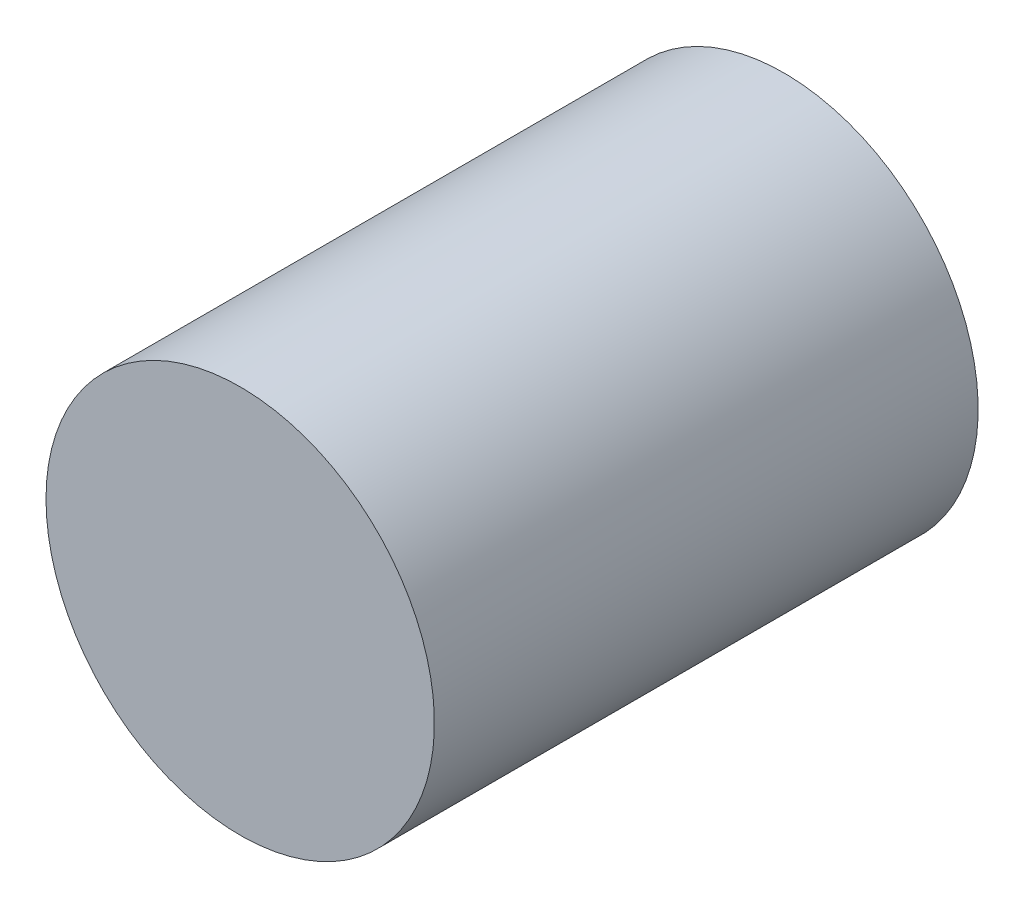
ISO-10303-21;
HEADER;
FILE_DESCRIPTION(('STEP AP214'),'2;1');
FILE_NAME('part.step','',(''),(''),'','','');
FILE_SCHEMA(('AUTOMOTIVE_DESIGN { 1 0 10303 214 1 1 1 1 }'));
ENDSEC;
DATA;
#1=APPLICATION_CONTEXT('core data for automotive mechanical design processes');
#2=APPLICATION_PROTOCOL_DEFINITION('international standard','automotive_design',2000,#1);
#3=PRODUCT_CONTEXT('',#1,'mechanical');
#4=PRODUCT('Part','Part','',(#3));
#5=PRODUCT_RELATED_PRODUCT_CATEGORY('part','',(#4));
#6=PRODUCT_DEFINITION_FORMATION('','',#4);
#7=PRODUCT_DEFINITION_CONTEXT('part definition',#1,'design');
#8=PRODUCT_DEFINITION('design','',#6,#7);
#9=PRODUCT_DEFINITION_SHAPE('','',#8);
#10=(LENGTH_UNIT() NAMED_UNIT(*) SI_UNIT(.MILLI.,.METRE.));
#11=(NAMED_UNIT(*) PLANE_ANGLE_UNIT() SI_UNIT($,.RADIAN.));
#12=(NAMED_UNIT(*) SI_UNIT($,.STERADIAN.) SOLID_ANGLE_UNIT());
#13=UNCERTAINTY_MEASURE_WITH_UNIT(LENGTH_MEASURE(1.E-05),#10,'distance_accuracy_value','');
#14=(GEOMETRIC_REPRESENTATION_CONTEXT(3) GLOBAL_UNCERTAINTY_ASSIGNED_CONTEXT((#13)) GLOBAL_UNIT_ASSIGNED_CONTEXT((#10,
#11,#12)) REPRESENTATION_CONTEXT('',''));
#15=CARTESIAN_POINT('',(0.,0.,0.));
#16=DIRECTION('',(0.,0.,1.));
#17=DIRECTION('',(1.,0.,0.));
#18=AXIS2_PLACEMENT_3D('',#15,#16,#17);
#19=CARTESIAN_POINT('',(0.,92.5,9.5));
#20=DIRECTION('',(0.,0.,-1.));
#21=DIRECTION('',(-1.,0.,0.));
#22=AXIS2_PLACEMENT_3D('',#19,#20,#21);
#23=CYLINDRICAL_SURFACE('',#22,5.);
#24=CARTESIAN_POINT('',(0.,92.5,9.5));
#25=DIRECTION('',(0.,0.,-1.));
#26=DIRECTION('',(-1.,0.,0.));
#27=AXIS2_PLACEMENT_3D('',#24,#25,#26);
#28=CIRCLE('',#27,5.);
#29=CARTESIAN_POINT('',(-5.,92.5,9.5));
#30=VERTEX_POINT('',#29);
#31=EDGE_CURVE('E10',#30,#30,#28,.T.);
#32=ORIENTED_EDGE('',*,*,#31,.T.);
#33=EDGE_LOOP('',(#32));
#34=FACE_BOUND('',#33,.T.);
#35=CARTESIAN_POINT('',(0.,92.5,-4.5));
#36=DIRECTION('',(0.,0.,-1.));
#37=DIRECTION('',(-1.,0.,0.));
#38=AXIS2_PLACEMENT_3D('',#35,#36,#37);
#39=CIRCLE('',#38,5.);
#40=CARTESIAN_POINT('',(-5.,92.5,-4.5));
#41=VERTEX_POINT('',#40);
#42=EDGE_CURVE('E40',#41,#41,#39,.T.);
#43=ORIENTED_EDGE('',*,*,#42,.F.);
#44=EDGE_LOOP('',(#43));
#45=FACE_BOUND('',#44,.T.);
#46=ADVANCED_FACE('F34',(#34,#45),#23,.T.);
#47=CARTESIAN_POINT('',(0.,92.5,9.5));
#48=DIRECTION('',(0.,0.,-1.));
#49=DIRECTION('',(-1.,0.,0.));
#50=AXIS2_PLACEMENT_3D('',#47,#48,#49);
#51=PLANE('',#50);
#52=ORIENTED_EDGE('',*,*,#31,.F.);
#53=EDGE_LOOP('',(#52));
#54=FACE_BOUND('',#53,.T.);
#55=ADVANCED_FACE('F49',(#54),#51,.F.);
#56=CARTESIAN_POINT('',(0.,92.5,-4.5));
#57=DIRECTION('',(0.,0.,-1.));
#58=DIRECTION('',(-1.,0.,0.));
#59=AXIS2_PLACEMENT_3D('',#56,#57,#58);
#60=PLANE('',#59);
#61=ORIENTED_EDGE('',*,*,#42,.T.);
#62=EDGE_LOOP('',(#61));
#63=FACE_BOUND('',#62,.T.);
#64=ADVANCED_FACE('F46',(#63),#60,.T.);
#65=CLOSED_SHELL('',(#46,#55,#64));
#66=MANIFOLD_SOLID_BREP('B2',#65);
#67=ADVANCED_BREP_SHAPE_REPRESENTATION('',(#18,#66),#14);
#68=SHAPE_DEFINITION_REPRESENTATION(#9,#67);
ENDSEC;
END-ISO-10303-21;
